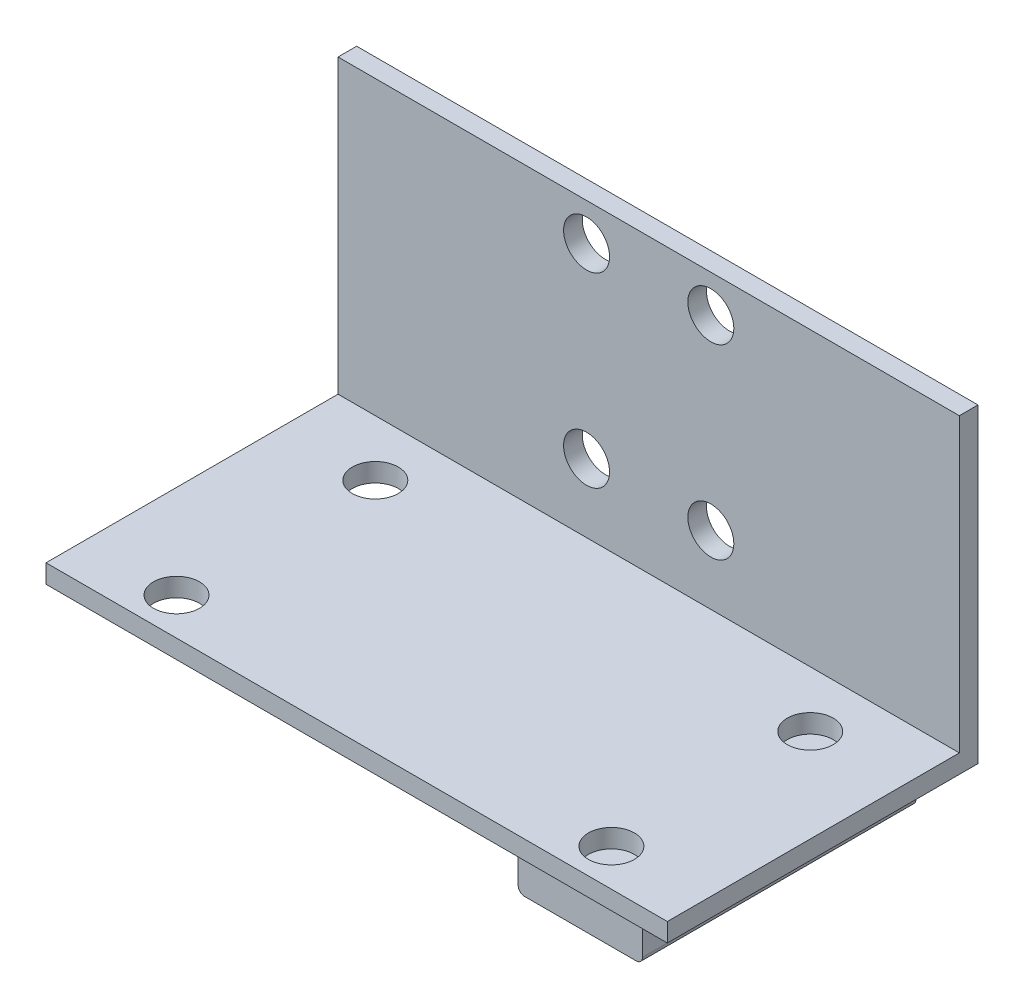
ISO-10303-21;
HEADER;
FILE_DESCRIPTION(('STEP AP214'),'2;1');
FILE_NAME('part.step','',(''),(''),'','','');
FILE_SCHEMA(('AUTOMOTIVE_DESIGN { 1 0 10303 214 1 1 1 1 }'));
ENDSEC;
DATA;
#1=APPLICATION_CONTEXT('core data for automotive mechanical design processes');
#2=APPLICATION_PROTOCOL_DEFINITION('international standard','automotive_design',2000,#1);
#3=PRODUCT_CONTEXT('',#1,'mechanical');
#4=PRODUCT('Part','Part','',(#3));
#5=PRODUCT_RELATED_PRODUCT_CATEGORY('part','',(#4));
#6=PRODUCT_DEFINITION_FORMATION('','',#4);
#7=PRODUCT_DEFINITION_CONTEXT('part definition',#1,'design');
#8=PRODUCT_DEFINITION('design','',#6,#7);
#9=PRODUCT_DEFINITION_SHAPE('','',#8);
#10=(LENGTH_UNIT() NAMED_UNIT(*) SI_UNIT(.MILLI.,.METRE.));
#11=(NAMED_UNIT(*) PLANE_ANGLE_UNIT() SI_UNIT($,.RADIAN.));
#12=(NAMED_UNIT(*) SI_UNIT($,.STERADIAN.) SOLID_ANGLE_UNIT());
#13=UNCERTAINTY_MEASURE_WITH_UNIT(LENGTH_MEASURE(1.E-05),#10,'distance_accuracy_value','');
#14=(GEOMETRIC_REPRESENTATION_CONTEXT(3) GLOBAL_UNCERTAINTY_ASSIGNED_CONTEXT((#13)) GLOBAL_UNIT_ASSIGNED_CONTEXT((#10,
#11,#12)) REPRESENTATION_CONTEXT('',''));
#15=CARTESIAN_POINT('',(0.,0.,0.));
#16=DIRECTION('',(0.,0.,1.));
#17=DIRECTION('',(1.,0.,0.));
#18=AXIS2_PLACEMENT_3D('',#15,#16,#17);
#19=CARTESIAN_POINT('',(0.,0.,0.));
#20=DIRECTION('',(0.,-1.,0.));
#21=DIRECTION('',(0.,0.,-1.));
#22=AXIS2_PLACEMENT_3D('',#19,#20,#21);
#23=PLANE('',#22);
#24=DIRECTION('',(0.,0.,1.));
#25=VECTOR('',#24,1.);
#26=CARTESIAN_POINT('',(0.,0.,0.));
#27=LINE('',#26,#25);
#28=CARTESIAN_POINT('',(0.,0.,-25.));
#29=VERTEX_POINT('',#28);
#30=CARTESIAN_POINT('',(0.,0.,0.));
#31=VERTEX_POINT('',#30);
#32=EDGE_CURVE('E219',#29,#31,#27,.T.);
#33=ORIENTED_EDGE('',*,*,#32,.F.);
#34=DIRECTION('',(-1.,0.,0.));
#35=VECTOR('',#34,1.);
#36=CARTESIAN_POINT('',(0.,0.,-25.));
#37=LINE('',#36,#35);
#38=CARTESIAN_POINT('',(50.,0.,-25.));
#39=VERTEX_POINT('',#38);
#40=EDGE_CURVE('E223',#39,#29,#37,.T.);
#41=ORIENTED_EDGE('',*,*,#40,.F.);
#42=DIRECTION('',(0.,0.,-1.));
#43=VECTOR('',#42,1.);
#44=CARTESIAN_POINT('',(50.,0.,0.));
#45=LINE('',#44,#43);
#46=CARTESIAN_POINT('',(50.,0.,0.));
#47=VERTEX_POINT('',#46);
#48=EDGE_CURVE('E232',#47,#39,#45,.T.);
#49=ORIENTED_EDGE('',*,*,#48,.F.);
#50=DIRECTION('',(1.,0.,0.));
#51=VECTOR('',#50,1.);
#52=CARTESIAN_POINT('',(0.,0.,0.));
#53=LINE('',#52,#51);
#54=EDGE_CURVE('E230',#31,#47,#53,.T.);
#55=ORIENTED_EDGE('',*,*,#54,.F.);
#56=EDGE_LOOP('',(#33,#41,#49,#55));
#57=FACE_BOUND('',#56,.T.);
#58=CARTESIAN_POINT('',(7.50000000000001,0.,-3.));
#59=DIRECTION('',(0.,-1.,0.));
#60=DIRECTION('',(0.,0.,-1.));
#61=AXIS2_PLACEMENT_3D('',#58,#59,#60);
#62=CIRCLE('',#61,1.85);
#63=CARTESIAN_POINT('',(7.50000000000001,0.,-4.85));
#64=VERTEX_POINT('',#63);
#65=EDGE_CURVE('E173',#64,#64,#62,.T.);
#66=ORIENTED_EDGE('',*,*,#65,.F.);
#67=EDGE_LOOP('',(#66));
#68=FACE_BOUND('',#67,.T.);
#69=CARTESIAN_POINT('',(7.50000000000001,0.,-19.));
#70=DIRECTION('',(0.,-1.,0.));
#71=DIRECTION('',(0.,0.,-1.));
#72=AXIS2_PLACEMENT_3D('',#69,#70,#71);
#73=CIRCLE('',#72,1.85);
#74=CARTESIAN_POINT('',(7.50000000000001,0.,-20.85));
#75=VERTEX_POINT('',#74);
#76=EDGE_CURVE('E184',#75,#75,#73,.T.);
#77=ORIENTED_EDGE('',*,*,#76,.F.);
#78=EDGE_LOOP('',(#77));
#79=FACE_BOUND('',#78,.T.);
#80=DIRECTION('',(-1.,0.,0.));
#81=VECTOR('',#80,1.);
#82=CARTESIAN_POINT('',(47.5,0.,-0.500000000000004));
#83=LINE('',#82,#81);
#84=CARTESIAN_POINT('',(47.5,0.,-0.500000000000004));
#85=VERTEX_POINT('',#84);
#86=CARTESIAN_POINT('',(37.5,0.,-0.500000000000004));
#87=VERTEX_POINT('',#86);
#88=EDGE_CURVE('E128',#85,#87,#83,.T.);
#89=ORIENTED_EDGE('',*,*,#88,.F.);
#90=DIRECTION('',(0.,0.,1.));
#91=VECTOR('',#90,1.);
#92=CARTESIAN_POINT('',(47.5,0.,-22.5));
#93=LINE('',#92,#91);
#94=CARTESIAN_POINT('',(47.5,0.,-22.5));
#95=VERTEX_POINT('',#94);
#96=EDGE_CURVE('E135',#95,#85,#93,.T.);
#97=ORIENTED_EDGE('',*,*,#96,.F.);
#98=DIRECTION('',(1.,0.,0.));
#99=VECTOR('',#98,1.);
#100=CARTESIAN_POINT('',(47.5,0.,-22.5));
#101=LINE('',#100,#99);
#102=CARTESIAN_POINT('',(37.5,0.,-22.5));
#103=VERTEX_POINT('',#102);
#104=EDGE_CURVE('E145',#103,#95,#101,.T.);
#105=ORIENTED_EDGE('',*,*,#104,.F.);
#106=DIRECTION('',(0.,0.,-1.));
#107=VECTOR('',#106,1.);
#108=CARTESIAN_POINT('',(37.5,0.,-22.5));
#109=LINE('',#108,#107);
#110=EDGE_CURVE('E143',#87,#103,#109,.T.);
#111=ORIENTED_EDGE('',*,*,#110,.F.);
#112=EDGE_LOOP('',(#89,#97,#105,#111));
#113=FACE_BOUND('',#112,.T.);
#114=ADVANCED_FACE('F34',(#57,#68,#79,#113),#23,.T.);
#115=CARTESIAN_POINT('',(0.,1.5,0.));
#116=DIRECTION('',(0.,-1.,0.));
#117=DIRECTION('',(0.,0.,-1.));
#118=AXIS2_PLACEMENT_3D('',#115,#116,#117);
#119=PLANE('',#118);
#120=CARTESIAN_POINT('',(7.50000000000001,1.5,-19.));
#121=DIRECTION('',(0.,1.,0.));
#122=DIRECTION('',(0.,0.,1.));
#123=AXIS2_PLACEMENT_3D('',#120,#121,#122);
#124=CIRCLE('',#123,1.85);
#125=CARTESIAN_POINT('',(7.50000000000001,1.5,-17.15));
#126=VERTEX_POINT('',#125);
#127=EDGE_CURVE('E165',#126,#126,#124,.T.);
#128=ORIENTED_EDGE('',*,*,#127,.F.);
#129=EDGE_LOOP('',(#128));
#130=FACE_BOUND('',#129,.T.);
#131=CARTESIAN_POINT('',(42.5,1.5,-3.));
#132=DIRECTION('',(0.,1.,0.));
#133=DIRECTION('',(0.,0.,1.));
#134=AXIS2_PLACEMENT_3D('',#131,#132,#133);
#135=CIRCLE('',#134,1.85);
#136=CARTESIAN_POINT('',(42.5,1.5,-1.15));
#137=VERTEX_POINT('',#136);
#138=EDGE_CURVE('E164',#137,#137,#135,.T.);
#139=ORIENTED_EDGE('',*,*,#138,.F.);
#140=EDGE_LOOP('',(#139));
#141=FACE_BOUND('',#140,.T.);
#142=CARTESIAN_POINT('',(42.5,1.5,-19.));
#143=DIRECTION('',(0.,1.,0.));
#144=DIRECTION('',(0.,0.,1.));
#145=AXIS2_PLACEMENT_3D('',#142,#143,#144);
#146=CIRCLE('',#145,1.85);
#147=CARTESIAN_POINT('',(42.5,1.5,-17.15));
#148=VERTEX_POINT('',#147);
#149=EDGE_CURVE('E161',#148,#148,#146,.T.);
#150=ORIENTED_EDGE('',*,*,#149,.F.);
#151=EDGE_LOOP('',(#150));
#152=FACE_BOUND('',#151,.T.);
#153=CARTESIAN_POINT('',(7.50000000000001,1.5,-3.));
#154=DIRECTION('',(0.,1.,0.));
#155=DIRECTION('',(0.,0.,1.));
#156=AXIS2_PLACEMENT_3D('',#153,#154,#155);
#157=CIRCLE('',#156,1.85);
#158=CARTESIAN_POINT('',(7.50000000000001,1.5,-1.15));
#159=VERTEX_POINT('',#158);
#160=EDGE_CURVE('E168',#159,#159,#157,.T.);
#161=ORIENTED_EDGE('',*,*,#160,.F.);
#162=EDGE_LOOP('',(#161));
#163=FACE_BOUND('',#162,.T.);
#164=DIRECTION('',(1.,0.,0.));
#165=VECTOR('',#164,1.);
#166=CARTESIAN_POINT('',(0.,1.5,-23.5));
#167=LINE('',#166,#165);
#168=CARTESIAN_POINT('',(0.,1.5,-23.5));
#169=VERTEX_POINT('',#168);
#170=CARTESIAN_POINT('',(50.,1.5,-23.5));
#171=VERTEX_POINT('',#170);
#172=EDGE_CURVE('E199',#169,#171,#167,.T.);
#173=ORIENTED_EDGE('',*,*,#172,.F.);
#174=DIRECTION('',(0.,0.,1.));
#175=VECTOR('',#174,1.);
#176=CARTESIAN_POINT('',(0.,1.5,0.));
#177=LINE('',#176,#175);
#178=CARTESIAN_POINT('',(0.,1.5,0.));
#179=VERTEX_POINT('',#178);
#180=EDGE_CURVE('E220',#169,#179,#177,.T.);
#181=ORIENTED_EDGE('',*,*,#180,.T.);
#182=DIRECTION('',(1.,0.,0.));
#183=VECTOR('',#182,1.);
#184=CARTESIAN_POINT('',(0.,1.5,0.));
#185=LINE('',#184,#183);
#186=CARTESIAN_POINT('',(50.,1.5,0.));
#187=VERTEX_POINT('',#186);
#188=EDGE_CURVE('E222',#179,#187,#185,.T.);
#189=ORIENTED_EDGE('',*,*,#188,.T.);
#190=DIRECTION('',(0.,0.,-1.));
#191=VECTOR('',#190,1.);
#192=CARTESIAN_POINT('',(50.,1.5,0.));
#193=LINE('',#192,#191);
#194=EDGE_CURVE('E225',#187,#171,#193,.T.);
#195=ORIENTED_EDGE('',*,*,#194,.T.);
#196=EDGE_LOOP('',(#173,#181,#189,#195));
#197=FACE_BOUND('',#196,.T.);
#198=ADVANCED_FACE('F279',(#130,#141,#152,#163,#197),#119,.F.);
#199=CARTESIAN_POINT('',(0.,1.5,0.));
#200=DIRECTION('',(1.,0.,0.));
#201=DIRECTION('',(0.,0.,-1.));
#202=AXIS2_PLACEMENT_3D('',#199,#200,#201);
#203=PLANE('',#202);
#204=ORIENTED_EDGE('',*,*,#32,.T.);
#205=DIRECTION('',(0.,-1.,0.));
#206=VECTOR('',#205,1.);
#207=CARTESIAN_POINT('',(0.,1.5,0.));
#208=LINE('',#207,#206);
#209=EDGE_CURVE('E243',#179,#31,#208,.T.);
#210=ORIENTED_EDGE('',*,*,#209,.F.);
#211=ORIENTED_EDGE('',*,*,#180,.F.);
#212=DIRECTION('',(0.,-1.,0.));
#213=VECTOR('',#212,1.);
#214=CARTESIAN_POINT('',(0.,25.,-23.5));
#215=LINE('',#214,#213);
#216=CARTESIAN_POINT('',(0.,25.,-23.5));
#217=VERTEX_POINT('',#216);
#218=EDGE_CURVE('E216',#217,#169,#215,.T.);
#219=ORIENTED_EDGE('',*,*,#218,.F.);
#220=DIRECTION('',(0.,0.,1.));
#221=VECTOR('',#220,1.);
#222=CARTESIAN_POINT('',(0.,25.,-25.));
#223=LINE('',#222,#221);
#224=CARTESIAN_POINT('',(0.,25.,-25.));
#225=VERTEX_POINT('',#224);
#226=EDGE_CURVE('E200',#225,#217,#223,.T.);
#227=ORIENTED_EDGE('',*,*,#226,.F.);
#228=DIRECTION('',(0.,-1.,0.));
#229=VECTOR('',#228,1.);
#230=CARTESIAN_POINT('',(0.,1.5,-25.));
#231=LINE('',#230,#229);
#232=EDGE_CURVE('E227',#225,#29,#231,.T.);
#233=ORIENTED_EDGE('',*,*,#232,.T.);
#234=EDGE_LOOP('',(#204,#210,#211,#219,#227,#233));
#235=FACE_BOUND('',#234,.T.);
#236=ADVANCED_FACE('F285',(#235),#203,.F.);
#237=CARTESIAN_POINT('',(0.,1.5,0.));
#238=DIRECTION('',(0.,0.,-1.));
#239=DIRECTION('',(-1.,0.,0.));
#240=AXIS2_PLACEMENT_3D('',#237,#238,#239);
#241=PLANE('',#240);
#242=ORIENTED_EDGE('',*,*,#54,.T.);
#243=DIRECTION('',(0.,-1.,0.));
#244=VECTOR('',#243,1.);
#245=CARTESIAN_POINT('',(50.,1.5,0.));
#246=LINE('',#245,#244);
#247=EDGE_CURVE('E240',#187,#47,#246,.T.);
#248=ORIENTED_EDGE('',*,*,#247,.F.);
#249=ORIENTED_EDGE('',*,*,#188,.F.);
#250=ORIENTED_EDGE('',*,*,#209,.T.);
#251=EDGE_LOOP('',(#242,#248,#249,#250));
#252=FACE_BOUND('',#251,.T.);
#253=ADVANCED_FACE('F300',(#252),#241,.F.);
#254=CARTESIAN_POINT('',(50.,1.5,0.));
#255=DIRECTION('',(-1.,0.,0.));
#256=DIRECTION('',(0.,0.,1.));
#257=AXIS2_PLACEMENT_3D('',#254,#255,#256);
#258=PLANE('',#257);
#259=ORIENTED_EDGE('',*,*,#48,.T.);
#260=DIRECTION('',(0.,-1.,0.));
#261=VECTOR('',#260,1.);
#262=CARTESIAN_POINT('',(50.,1.5,-25.));
#263=LINE('',#262,#261);
#264=CARTESIAN_POINT('',(50.,25.,-25.));
#265=VERTEX_POINT('',#264);
#266=EDGE_CURVE('E237',#265,#39,#263,.T.);
#267=ORIENTED_EDGE('',*,*,#266,.F.);
#268=DIRECTION('',(0.,0.,-1.));
#269=VECTOR('',#268,1.);
#270=CARTESIAN_POINT('',(50.,25.,-25.));
#271=LINE('',#270,#269);
#272=CARTESIAN_POINT('',(50.,25.,-23.5));
#273=VERTEX_POINT('',#272);
#274=EDGE_CURVE('E205',#273,#265,#271,.T.);
#275=ORIENTED_EDGE('',*,*,#274,.F.);
#276=DIRECTION('',(0.,-1.,0.));
#277=VECTOR('',#276,1.);
#278=CARTESIAN_POINT('',(50.,25.,-23.5));
#279=LINE('',#278,#277);
#280=EDGE_CURVE('E211',#273,#171,#279,.T.);
#281=ORIENTED_EDGE('',*,*,#280,.T.);
#282=ORIENTED_EDGE('',*,*,#194,.F.);
#283=ORIENTED_EDGE('',*,*,#247,.T.);
#284=EDGE_LOOP('',(#259,#267,#275,#281,#282,#283));
#285=FACE_BOUND('',#284,.T.);
#286=ADVANCED_FACE('F296',(#285),#258,.F.);
#287=CARTESIAN_POINT('',(0.,1.5,-25.));
#288=DIRECTION('',(0.,0.,1.));
#289=DIRECTION('',(1.,0.,0.));
#290=AXIS2_PLACEMENT_3D('',#287,#288,#289);
#291=PLANE('',#290);
#292=CARTESIAN_POINT('',(20.,7.,-25.));
#293=DIRECTION('',(0.,0.,1.));
#294=DIRECTION('',(1.,0.,0.));
#295=AXIS2_PLACEMENT_3D('',#292,#293,#294);
#296=CIRCLE('',#295,1.85);
#297=CARTESIAN_POINT('',(21.85,7.,-25.));
#298=VERTEX_POINT('',#297);
#299=EDGE_CURVE('E196',#298,#298,#296,.T.);
#300=ORIENTED_EDGE('',*,*,#299,.T.);
#301=EDGE_LOOP('',(#300));
#302=FACE_BOUND('',#301,.T.);
#303=CARTESIAN_POINT('',(30.,7.,-25.));
#304=DIRECTION('',(0.,0.,1.));
#305=DIRECTION('',(1.,0.,0.));
#306=AXIS2_PLACEMENT_3D('',#303,#304,#305);
#307=CIRCLE('',#306,1.85);
#308=CARTESIAN_POINT('',(31.85,7.,-25.));
#309=VERTEX_POINT('',#308);
#310=EDGE_CURVE('E193',#309,#309,#307,.T.);
#311=ORIENTED_EDGE('',*,*,#310,.T.);
#312=EDGE_LOOP('',(#311));
#313=FACE_BOUND('',#312,.T.);
#314=CARTESIAN_POINT('',(30.,22.,-25.));
#315=DIRECTION('',(0.,0.,1.));
#316=DIRECTION('',(1.,0.,0.));
#317=AXIS2_PLACEMENT_3D('',#314,#315,#316);
#318=CIRCLE('',#317,1.85);
#319=CARTESIAN_POINT('',(31.85,22.,-25.));
#320=VERTEX_POINT('',#319);
#321=EDGE_CURVE('E190',#320,#320,#318,.T.);
#322=ORIENTED_EDGE('',*,*,#321,.T.);
#323=EDGE_LOOP('',(#322));
#324=FACE_BOUND('',#323,.T.);
#325=CARTESIAN_POINT('',(20.,22.,-25.));
#326=DIRECTION('',(0.,0.,1.));
#327=DIRECTION('',(1.,0.,0.));
#328=AXIS2_PLACEMENT_3D('',#325,#326,#327);
#329=CIRCLE('',#328,1.85);
#330=CARTESIAN_POINT('',(21.85,22.,-25.));
#331=VERTEX_POINT('',#330);
#332=EDGE_CURVE('E187',#331,#331,#329,.T.);
#333=ORIENTED_EDGE('',*,*,#332,.T.);
#334=EDGE_LOOP('',(#333));
#335=FACE_BOUND('',#334,.T.);
#336=ORIENTED_EDGE('',*,*,#40,.T.);
#337=ORIENTED_EDGE('',*,*,#232,.F.);
#338=DIRECTION('',(-1.,0.,0.));
#339=VECTOR('',#338,1.);
#340=CARTESIAN_POINT('',(0.,25.,-25.));
#341=LINE('',#340,#339);
#342=EDGE_CURVE('E208',#265,#225,#341,.T.);
#343=ORIENTED_EDGE('',*,*,#342,.F.);
#344=ORIENTED_EDGE('',*,*,#266,.T.);
#345=EDGE_LOOP('',(#336,#337,#343,#344));
#346=FACE_BOUND('',#345,.T.);
#347=ADVANCED_FACE('F292',(#302,#313,#324,#335,#346),#291,.F.);
#348=CARTESIAN_POINT('',(0.,25.,-23.5));
#349=DIRECTION('',(0.,0.,-1.));
#350=DIRECTION('',(-1.,0.,0.));
#351=AXIS2_PLACEMENT_3D('',#348,#349,#350);
#352=PLANE('',#351);
#353=CARTESIAN_POINT('',(20.,7.,-23.5));
#354=DIRECTION('',(0.,0.,1.));
#355=DIRECTION('',(1.,0.,0.));
#356=AXIS2_PLACEMENT_3D('',#353,#354,#355);
#357=CIRCLE('',#356,1.85);
#358=CARTESIAN_POINT('',(21.85,7.,-23.5));
#359=VERTEX_POINT('',#358);
#360=EDGE_CURVE('E181',#359,#359,#357,.T.);
#361=ORIENTED_EDGE('',*,*,#360,.F.);
#362=EDGE_LOOP('',(#361));
#363=FACE_BOUND('',#362,.T.);
#364=CARTESIAN_POINT('',(30.,7.,-23.5));
#365=DIRECTION('',(0.,0.,1.));
#366=DIRECTION('',(1.,0.,0.));
#367=AXIS2_PLACEMENT_3D('',#364,#365,#366);
#368=CIRCLE('',#367,1.85);
#369=CARTESIAN_POINT('',(31.85,7.,-23.5));
#370=VERTEX_POINT('',#369);
#371=EDGE_CURVE('E178',#370,#370,#368,.T.);
#372=ORIENTED_EDGE('',*,*,#371,.F.);
#373=EDGE_LOOP('',(#372));
#374=FACE_BOUND('',#373,.T.);
#375=CARTESIAN_POINT('',(30.,22.,-23.5));
#376=DIRECTION('',(0.,0.,1.));
#377=DIRECTION('',(1.,0.,0.));
#378=AXIS2_PLACEMENT_3D('',#375,#376,#377);
#379=CIRCLE('',#378,1.85);
#380=CARTESIAN_POINT('',(31.85,22.,-23.5));
#381=VERTEX_POINT('',#380);
#382=EDGE_CURVE('E174',#381,#381,#379,.T.);
#383=ORIENTED_EDGE('',*,*,#382,.F.);
#384=EDGE_LOOP('',(#383));
#385=FACE_BOUND('',#384,.T.);
#386=CARTESIAN_POINT('',(20.,22.,-23.5));
#387=DIRECTION('',(0.,0.,1.));
#388=DIRECTION('',(1.,0.,0.));
#389=AXIS2_PLACEMENT_3D('',#386,#387,#388);
#390=CIRCLE('',#389,1.85);
#391=CARTESIAN_POINT('',(21.85,22.,-23.5));
#392=VERTEX_POINT('',#391);
#393=EDGE_CURVE('E177',#392,#392,#390,.T.);
#394=ORIENTED_EDGE('',*,*,#393,.F.);
#395=EDGE_LOOP('',(#394));
#396=FACE_BOUND('',#395,.T.);
#397=ORIENTED_EDGE('',*,*,#172,.T.);
#398=ORIENTED_EDGE('',*,*,#280,.F.);
#399=DIRECTION('',(1.,0.,0.));
#400=VECTOR('',#399,1.);
#401=CARTESIAN_POINT('',(0.,25.,-23.5));
#402=LINE('',#401,#400);
#403=EDGE_CURVE('E203',#217,#273,#402,.T.);
#404=ORIENTED_EDGE('',*,*,#403,.F.);
#405=ORIENTED_EDGE('',*,*,#218,.T.);
#406=EDGE_LOOP('',(#397,#398,#404,#405));
#407=FACE_BOUND('',#406,.T.);
#408=ADVANCED_FACE('F295',(#363,#374,#385,#396,#407),#352,.F.);
#409=CARTESIAN_POINT('',(0.,25.,0.));
#410=DIRECTION('',(0.,1.,0.));
#411=DIRECTION('',(0.,0.,1.));
#412=AXIS2_PLACEMENT_3D('',#409,#410,#411);
#413=PLANE('',#412);
#414=ORIENTED_EDGE('',*,*,#226,.T.);
#415=ORIENTED_EDGE('',*,*,#403,.T.);
#416=ORIENTED_EDGE('',*,*,#274,.T.);
#417=ORIENTED_EDGE('',*,*,#342,.T.);
#418=EDGE_LOOP('',(#414,#415,#416,#417));
#419=FACE_BOUND('',#418,.T.);
#420=ADVANCED_FACE('F322',(#419),#413,.T.);
#421=CARTESIAN_POINT('',(20.,22.,-46.5));
#422=DIRECTION('',(0.,0.,1.));
#423=DIRECTION('',(1.,0.,0.));
#424=AXIS2_PLACEMENT_3D('',#421,#422,#423);
#425=CYLINDRICAL_SURFACE('',#424,1.85);
#426=ORIENTED_EDGE('',*,*,#393,.T.);
#427=EDGE_LOOP('',(#426));
#428=FACE_BOUND('',#427,.T.);
#429=ORIENTED_EDGE('',*,*,#332,.F.);
#430=EDGE_LOOP('',(#429));
#431=FACE_BOUND('',#430,.T.);
#432=ADVANCED_FACE('F326',(#428,#431),#425,.F.);
#433=CARTESIAN_POINT('',(30.,22.,-46.5));
#434=DIRECTION('',(0.,0.,1.));
#435=DIRECTION('',(1.,0.,0.));
#436=AXIS2_PLACEMENT_3D('',#433,#434,#435);
#437=CYLINDRICAL_SURFACE('',#436,1.85);
#438=ORIENTED_EDGE('',*,*,#382,.T.);
#439=EDGE_LOOP('',(#438));
#440=FACE_BOUND('',#439,.T.);
#441=ORIENTED_EDGE('',*,*,#321,.F.);
#442=EDGE_LOOP('',(#441));
#443=FACE_BOUND('',#442,.T.);
#444=ADVANCED_FACE('F332',(#440,#443),#437,.F.);
#445=CARTESIAN_POINT('',(30.,7.,-46.5));
#446=DIRECTION('',(0.,0.,1.));
#447=DIRECTION('',(1.,0.,0.));
#448=AXIS2_PLACEMENT_3D('',#445,#446,#447);
#449=CYLINDRICAL_SURFACE('',#448,1.85);
#450=ORIENTED_EDGE('',*,*,#371,.T.);
#451=EDGE_LOOP('',(#450));
#452=FACE_BOUND('',#451,.T.);
#453=ORIENTED_EDGE('',*,*,#310,.F.);
#454=EDGE_LOOP('',(#453));
#455=FACE_BOUND('',#454,.T.);
#456=ADVANCED_FACE('F341',(#452,#455),#449,.F.);
#457=CARTESIAN_POINT('',(20.,7.,-46.5));
#458=DIRECTION('',(0.,0.,1.));
#459=DIRECTION('',(1.,0.,0.));
#460=AXIS2_PLACEMENT_3D('',#457,#458,#459);
#461=CYLINDRICAL_SURFACE('',#460,1.85);
#462=ORIENTED_EDGE('',*,*,#360,.T.);
#463=EDGE_LOOP('',(#462));
#464=FACE_BOUND('',#463,.T.);
#465=ORIENTED_EDGE('',*,*,#299,.F.);
#466=EDGE_LOOP('',(#465));
#467=FACE_BOUND('',#466,.T.);
#468=ADVANCED_FACE('F337',(#464,#467),#461,.F.);
#469=CARTESIAN_POINT('',(7.50000000000001,-21.5,-3.));
#470=DIRECTION('',(0.,1.,0.));
#471=DIRECTION('',(0.,0.,1.));
#472=AXIS2_PLACEMENT_3D('',#469,#470,#471);
#473=CYLINDRICAL_SURFACE('',#472,1.85);
#474=ORIENTED_EDGE('',*,*,#65,.T.);
#475=EDGE_LOOP('',(#474));
#476=FACE_BOUND('',#475,.T.);
#477=ORIENTED_EDGE('',*,*,#160,.T.);
#478=EDGE_LOOP('',(#477));
#479=FACE_BOUND('',#478,.T.);
#480=ADVANCED_FACE('F340',(#476,#479),#473,.F.);
#481=CARTESIAN_POINT('',(42.5,-21.5,-19.));
#482=DIRECTION('',(0.,1.,0.));
#483=DIRECTION('',(0.,0.,1.));
#484=AXIS2_PLACEMENT_3D('',#481,#482,#483);
#485=CYLINDRICAL_SURFACE('',#484,1.85);
#486=CARTESIAN_POINT('',(42.5,0.,-19.));
#487=DIRECTION('',(0.,-1.,0.));
#488=DIRECTION('',(0.,0.,-1.));
#489=AXIS2_PLACEMENT_3D('',#486,#487,#488);
#490=CIRCLE('',#489,1.85);
#491=CARTESIAN_POINT('',(42.5,0.,-20.85));
#492=VERTEX_POINT('',#491);
#493=EDGE_CURVE('E158',#492,#492,#490,.F.);
#494=ORIENTED_EDGE('',*,*,#493,.F.);
#495=EDGE_LOOP('',(#494));
#496=FACE_BOUND('',#495,.T.);
#497=ORIENTED_EDGE('',*,*,#149,.T.);
#498=EDGE_LOOP('',(#497));
#499=FACE_BOUND('',#498,.T.);
#500=ADVANCED_FACE('F351',(#496,#499),#485,.F.);
#501=CARTESIAN_POINT('',(42.5,-21.5,-3.));
#502=DIRECTION('',(0.,1.,0.));
#503=DIRECTION('',(0.,0.,1.));
#504=AXIS2_PLACEMENT_3D('',#501,#502,#503);
#505=CYLINDRICAL_SURFACE('',#504,1.85);
#506=CARTESIAN_POINT('',(42.5,0.,-3.));
#507=DIRECTION('',(0.,-1.,0.));
#508=DIRECTION('',(0.,0.,-1.));
#509=AXIS2_PLACEMENT_3D('',#506,#507,#508);
#510=CIRCLE('',#509,1.85);
#511=CARTESIAN_POINT('',(42.5,0.,-4.85000000000001));
#512=VERTEX_POINT('',#511);
#513=EDGE_CURVE('E131',#512,#512,#510,.F.);
#514=ORIENTED_EDGE('',*,*,#513,.F.);
#515=EDGE_LOOP('',(#514));
#516=FACE_BOUND('',#515,.T.);
#517=ORIENTED_EDGE('',*,*,#138,.T.);
#518=EDGE_LOOP('',(#517));
#519=FACE_BOUND('',#518,.T.);
#520=ADVANCED_FACE('F353',(#516,#519),#505,.F.);
#521=CARTESIAN_POINT('',(7.50000000000001,-21.5,-19.));
#522=DIRECTION('',(0.,1.,0.));
#523=DIRECTION('',(0.,0.,1.));
#524=AXIS2_PLACEMENT_3D('',#521,#522,#523);
#525=CYLINDRICAL_SURFACE('',#524,1.85);
#526=ORIENTED_EDGE('',*,*,#76,.T.);
#527=EDGE_LOOP('',(#526));
#528=FACE_BOUND('',#527,.T.);
#529=ORIENTED_EDGE('',*,*,#127,.T.);
#530=EDGE_LOOP('',(#529));
#531=FACE_BOUND('',#530,.T.);
#532=ADVANCED_FACE('F356',(#528,#531),#525,.F.);
#533=CARTESIAN_POINT('',(0.,0.,0.));
#534=DIRECTION('',(0.,-1.,0.));
#535=DIRECTION('',(0.,0.,-1.));
#536=AXIS2_PLACEMENT_3D('',#533,#534,#535);
#537=PLANE('',#536);
#538=ORIENTED_EDGE('',*,*,#513,.T.);
#539=EDGE_LOOP('',(#538));
#540=FACE_BOUND('',#539,.T.);
#541=ADVANCED_FACE('F360',(#540),#537,.F.);
#542=ORIENTED_EDGE('',*,*,#493,.T.);
#543=EDGE_LOOP('',(#542));
#544=FACE_BOUND('',#543,.T.);
#545=ADVANCED_FACE('F367',(#544),#537,.F.);
#546=CARTESIAN_POINT('',(47.5,-3.,-22.5));
#547=DIRECTION('',(-1.,0.,0.));
#548=DIRECTION('',(0.,0.,1.));
#549=AXIS2_PLACEMENT_3D('',#546,#547,#548);
#550=PLANE('',#549);
#551=DIRECTION('',(0.,1.,0.));
#552=VECTOR('',#551,1.);
#553=CARTESIAN_POINT('',(47.5,-3.,-0.500000000000004));
#554=LINE('',#553,#552);
#555=CARTESIAN_POINT('',(47.5,-2.5,-0.500000000000004));
#556=VERTEX_POINT('',#555);
#557=EDGE_CURVE('E122',#556,#85,#554,.T.);
#558=ORIENTED_EDGE('',*,*,#557,.F.);
#559=DIRECTION('',(0.,0.,1.));
#560=VECTOR('',#559,1.);
#561=CARTESIAN_POINT('',(47.5,-2.5,-22.5));
#562=LINE('',#561,#560);
#563=CARTESIAN_POINT('',(47.5,-2.5,-22.5));
#564=VERTEX_POINT('',#563);
#565=EDGE_CURVE('E57',#556,#564,#562,.F.);
#566=ORIENTED_EDGE('',*,*,#565,.T.);
#567=DIRECTION('',(0.,1.,0.));
#568=VECTOR('',#567,1.);
#569=CARTESIAN_POINT('',(47.5,-3.,-22.5));
#570=LINE('',#569,#568);
#571=EDGE_CURVE('E137',#564,#95,#570,.T.);
#572=ORIENTED_EDGE('',*,*,#571,.T.);
#573=ORIENTED_EDGE('',*,*,#96,.T.);
#574=EDGE_LOOP('',(#558,#566,#572,#573));
#575=FACE_BOUND('',#574,.T.);
#576=ADVANCED_FACE('F136',(#575),#550,.F.);
#577=CARTESIAN_POINT('',(47.5,-3.,-0.500000000000004));
#578=DIRECTION('',(0.,0.,-1.));
#579=DIRECTION('',(-1.,0.,0.));
#580=AXIS2_PLACEMENT_3D('',#577,#578,#579);
#581=PLANE('',#580);
#582=DIRECTION('',(-1.,0.,0.));
#583=VECTOR('',#582,1.);
#584=CARTESIAN_POINT('',(47.5,-3.,-0.500000000000004));
#585=LINE('',#584,#583);
#586=CARTESIAN_POINT('',(47.,-3.,-0.500000000000004));
#587=VERTEX_POINT('',#586);
#588=CARTESIAN_POINT('',(38.,-3.,-0.500000000000004));
#589=VERTEX_POINT('',#588);
#590=EDGE_CURVE('E150',#587,#589,#585,.T.);
#591=ORIENTED_EDGE('',*,*,#590,.F.);
#592=CARTESIAN_POINT('',(47.,-2.5,-0.500000000000004));
#593=DIRECTION('',(0.,0.,-1.));
#594=DIRECTION('',(-1.,0.,0.));
#595=AXIS2_PLACEMENT_3D('',#592,#593,#594);
#596=CIRCLE('',#595,0.5);
#597=EDGE_CURVE('E130',#587,#556,#596,.F.);
#598=ORIENTED_EDGE('',*,*,#597,.T.);
#599=ORIENTED_EDGE('',*,*,#557,.T.);
#600=ORIENTED_EDGE('',*,*,#88,.T.);
#601=DIRECTION('',(0.,1.,0.));
#602=VECTOR('',#601,1.);
#603=CARTESIAN_POINT('',(37.5,-3.,-0.500000000000004));
#604=LINE('',#603,#602);
#605=CARTESIAN_POINT('',(37.5,-2.5,-0.500000000000004));
#606=VERTEX_POINT('',#605);
#607=EDGE_CURVE('E132',#606,#87,#604,.T.);
#608=ORIENTED_EDGE('',*,*,#607,.F.);
#609=CARTESIAN_POINT('',(38.,-2.5,-0.500000000000004));
#610=DIRECTION('',(0.,0.,-1.));
#611=DIRECTION('',(-1.,0.,0.));
#612=AXIS2_PLACEMENT_3D('',#609,#610,#611);
#613=CIRCLE('',#612,0.5);
#614=EDGE_CURVE('E256',#606,#589,#613,.F.);
#615=ORIENTED_EDGE('',*,*,#614,.T.);
#616=EDGE_LOOP('',(#591,#598,#599,#600,#608,#615));
#617=FACE_BOUND('',#616,.T.);
#618=ADVANCED_FACE('F125',(#617),#581,.F.);
#619=CARTESIAN_POINT('',(37.5,-3.,-22.5));
#620=DIRECTION('',(1.,0.,0.));
#621=DIRECTION('',(0.,0.,-1.));
#622=AXIS2_PLACEMENT_3D('',#619,#620,#621);
#623=PLANE('',#622);
#624=DIRECTION('',(0.,1.,0.));
#625=VECTOR('',#624,1.);
#626=CARTESIAN_POINT('',(37.5,-3.,-22.5));
#627=LINE('',#626,#625);
#628=CARTESIAN_POINT('',(37.5,-2.5,-22.5));
#629=VERTEX_POINT('',#628);
#630=EDGE_CURVE('E152',#629,#103,#627,.T.);
#631=ORIENTED_EDGE('',*,*,#630,.F.);
#632=DIRECTION('',(0.,0.,-1.));
#633=VECTOR('',#632,1.);
#634=CARTESIAN_POINT('',(37.5,-2.5,-0.500000000000004));
#635=LINE('',#634,#633);
#636=EDGE_CURVE('E11',#629,#606,#635,.F.);
#637=ORIENTED_EDGE('',*,*,#636,.T.);
#638=ORIENTED_EDGE('',*,*,#607,.T.);
#639=ORIENTED_EDGE('',*,*,#110,.T.);
#640=EDGE_LOOP('',(#631,#637,#638,#639));
#641=FACE_BOUND('',#640,.T.);
#642=ADVANCED_FACE('F370',(#641),#623,.F.);
#643=CARTESIAN_POINT('',(47.5,-3.,-22.5));
#644=DIRECTION('',(0.,0.,1.));
#645=DIRECTION('',(1.,0.,0.));
#646=AXIS2_PLACEMENT_3D('',#643,#644,#645);
#647=PLANE('',#646);
#648=ORIENTED_EDGE('',*,*,#571,.F.);
#649=CARTESIAN_POINT('',(47.,-2.5,-22.5));
#650=DIRECTION('',(0.,0.,1.));
#651=DIRECTION('',(1.,0.,0.));
#652=AXIS2_PLACEMENT_3D('',#649,#650,#651);
#653=CIRCLE('',#652,0.5);
#654=CARTESIAN_POINT('',(47.,-3.,-22.5));
#655=VERTEX_POINT('',#654);
#656=EDGE_CURVE('E42',#564,#655,#653,.F.);
#657=ORIENTED_EDGE('',*,*,#656,.T.);
#658=DIRECTION('',(1.,0.,0.));
#659=VECTOR('',#658,1.);
#660=CARTESIAN_POINT('',(47.5,-3.,-22.5));
#661=LINE('',#660,#659);
#662=CARTESIAN_POINT('',(38.,-3.,-22.5));
#663=VERTEX_POINT('',#662);
#664=EDGE_CURVE('E153',#663,#655,#661,.T.);
#665=ORIENTED_EDGE('',*,*,#664,.F.);
#666=CARTESIAN_POINT('',(38.,-2.5,-22.5));
#667=DIRECTION('',(0.,0.,1.));
#668=DIRECTION('',(1.,0.,0.));
#669=AXIS2_PLACEMENT_3D('',#666,#667,#668);
#670=CIRCLE('',#669,0.5);
#671=EDGE_CURVE('E49',#663,#629,#670,.F.);
#672=ORIENTED_EDGE('',*,*,#671,.T.);
#673=ORIENTED_EDGE('',*,*,#630,.T.);
#674=ORIENTED_EDGE('',*,*,#104,.T.);
#675=EDGE_LOOP('',(#648,#657,#665,#672,#673,#674));
#676=FACE_BOUND('',#675,.T.);
#677=ADVANCED_FACE('F262',(#676),#647,.F.);
#678=CARTESIAN_POINT('',(0.,-3.,0.));
#679=DIRECTION('',(0.,-1.,0.));
#680=DIRECTION('',(0.,0.,-1.));
#681=AXIS2_PLACEMENT_3D('',#678,#679,#680);
#682=PLANE('',#681);
#683=ORIENTED_EDGE('',*,*,#664,.T.);
#684=DIRECTION('',(0.,0.,1.));
#685=VECTOR('',#684,1.);
#686=CARTESIAN_POINT('',(47.,-3.,-0.500000000000004));
#687=LINE('',#686,#685);
#688=EDGE_CURVE('E253',#655,#587,#687,.T.);
#689=ORIENTED_EDGE('',*,*,#688,.T.);
#690=ORIENTED_EDGE('',*,*,#590,.T.);
#691=DIRECTION('',(0.,0.,-1.));
#692=VECTOR('',#691,1.);
#693=CARTESIAN_POINT('',(38.,-3.,-22.5));
#694=LINE('',#693,#692);
#695=EDGE_CURVE('E246',#589,#663,#694,.T.);
#696=ORIENTED_EDGE('',*,*,#695,.T.);
#697=EDGE_LOOP('',(#683,#689,#690,#696));
#698=FACE_BOUND('',#697,.T.);
#699=ADVANCED_FACE('F266',(#698),#682,.T.);
#700=CARTESIAN_POINT('',(47.,-2.5,0.));
#701=DIRECTION('',(0.,0.,-1.));
#702=DIRECTION('',(-1.,0.,0.));
#703=AXIS2_PLACEMENT_3D('',#700,#701,#702);
#704=CYLINDRICAL_SURFACE('',#703,0.5);
#705=ORIENTED_EDGE('',*,*,#656,.F.);
#706=ORIENTED_EDGE('',*,*,#565,.F.);
#707=ORIENTED_EDGE('',*,*,#597,.F.);
#708=ORIENTED_EDGE('',*,*,#688,.F.);
#709=EDGE_LOOP('',(#705,#706,#707,#708));
#710=FACE_BOUND('',#709,.T.);
#711=ADVANCED_FACE('F269',(#710),#704,.T.);
#712=CARTESIAN_POINT('',(38.,-2.5,0.));
#713=DIRECTION('',(0.,0.,1.));
#714=DIRECTION('',(1.,0.,0.));
#715=AXIS2_PLACEMENT_3D('',#712,#713,#714);
#716=CYLINDRICAL_SURFACE('',#715,0.5);
#717=ORIENTED_EDGE('',*,*,#614,.F.);
#718=ORIENTED_EDGE('',*,*,#636,.F.);
#719=ORIENTED_EDGE('',*,*,#671,.F.);
#720=ORIENTED_EDGE('',*,*,#695,.F.);
#721=EDGE_LOOP('',(#717,#718,#719,#720));
#722=FACE_BOUND('',#721,.T.);
#723=ADVANCED_FACE('F36',(#722),#716,.T.);
#724=CLOSED_SHELL('',(#114,#198,#236,#253,#286,#347,#408,#420,#432,#444,#456,#468,#480,#500,
#520,#532,#541,#545,#576,#618,#642,#677,#699,#711,#723));
#725=MANIFOLD_SOLID_BREP('B2',#724);
#726=ADVANCED_BREP_SHAPE_REPRESENTATION('',(#18,#725),#14);
#727=SHAPE_DEFINITION_REPRESENTATION(#9,#726);
ENDSEC;
END-ISO-10303-21;
